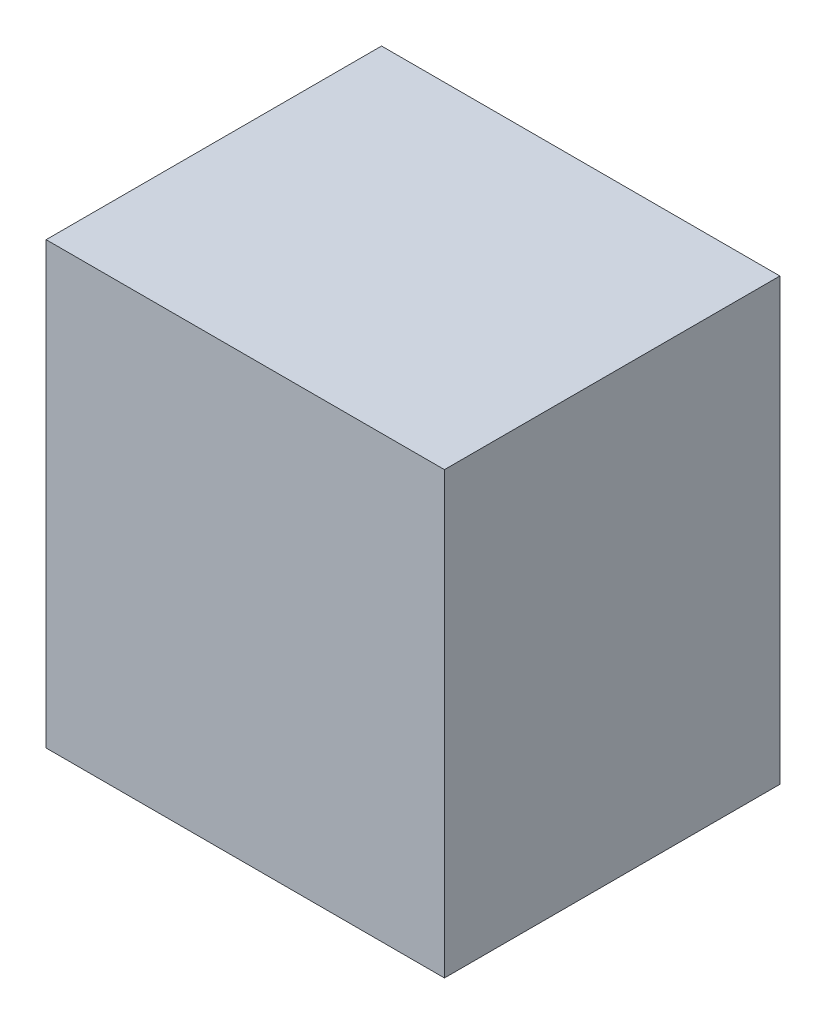
ISO-10303-21;
HEADER;
FILE_DESCRIPTION(('STEP AP214'),'2;1');
FILE_NAME('part.step','',(''),(''),'','','');
FILE_SCHEMA(('AUTOMOTIVE_DESIGN { 1 0 10303 214 1 1 1 1 }'));
ENDSEC;
DATA;
#1=APPLICATION_CONTEXT('core data for automotive mechanical design processes');
#2=APPLICATION_PROTOCOL_DEFINITION('international standard','automotive_design',2000,#1);
#3=PRODUCT_CONTEXT('',#1,'mechanical');
#4=PRODUCT('Part','Part','',(#3));
#5=PRODUCT_RELATED_PRODUCT_CATEGORY('part','',(#4));
#6=PRODUCT_DEFINITION_FORMATION('','',#4);
#7=PRODUCT_DEFINITION_CONTEXT('part definition',#1,'design');
#8=PRODUCT_DEFINITION('design','',#6,#7);
#9=PRODUCT_DEFINITION_SHAPE('','',#8);
#10=(LENGTH_UNIT() NAMED_UNIT(*) SI_UNIT(.MILLI.,.METRE.));
#11=(NAMED_UNIT(*) PLANE_ANGLE_UNIT() SI_UNIT($,.RADIAN.));
#12=(NAMED_UNIT(*) SI_UNIT($,.STERADIAN.) SOLID_ANGLE_UNIT());
#13=UNCERTAINTY_MEASURE_WITH_UNIT(LENGTH_MEASURE(1.E-05),#10,'distance_accuracy_value','');
#14=(GEOMETRIC_REPRESENTATION_CONTEXT(3) GLOBAL_UNCERTAINTY_ASSIGNED_CONTEXT((#13)) GLOBAL_UNIT_ASSIGNED_CONTEXT((#10,
#11,#12)) REPRESENTATION_CONTEXT('',''));
#15=CARTESIAN_POINT('',(0.,0.,0.));
#16=DIRECTION('',(0.,0.,1.));
#17=DIRECTION('',(1.,0.,0.));
#18=AXIS2_PLACEMENT_3D('',#15,#16,#17);
#19=CARTESIAN_POINT('',(0.47500032,-0.52500022,0.80000094));
#20=DIRECTION('',(0.,0.,1.));
#21=DIRECTION('',(1.,0.,0.));
#22=AXIS2_PLACEMENT_3D('',#19,#20,#21);
#23=PLANE('',#22);
#24=DIRECTION('',(0.,1.,0.));
#25=VECTOR('',#24,1.);
#26=CARTESIAN_POINT('',(-0.47499778,-0.52500022,0.80000094));
#27=LINE('',#26,#25);
#28=CARTESIAN_POINT('',(-0.47499778,-0.52500022,0.80000094));
#29=VERTEX_POINT('',#28);
#30=CARTESIAN_POINT('',(-0.47499778,0.52500022,0.80000094));
#31=VERTEX_POINT('',#30);
#32=EDGE_CURVE('E52',#29,#31,#27,.T.);
#33=ORIENTED_EDGE('',*,*,#32,.F.);
#34=DIRECTION('',(1.,0.,0.));
#35=VECTOR('',#34,1.);
#36=CARTESIAN_POINT('',(0.47500032,-0.52500022,0.80000094));
#37=LINE('',#36,#35);
#38=CARTESIAN_POINT('',(0.47500032,-0.52500022,0.80000094));
#39=VERTEX_POINT('',#38);
#40=EDGE_CURVE('E67',#39,#29,#37,.F.);
#41=ORIENTED_EDGE('',*,*,#40,.F.);
#42=DIRECTION('',(0.,1.,0.));
#43=VECTOR('',#42,1.);
#44=CARTESIAN_POINT('',(0.47500032,0.52500022,0.80000094));
#45=LINE('',#44,#43);
#46=CARTESIAN_POINT('',(0.47500032,0.52500022,0.80000094));
#47=VERTEX_POINT('',#46);
#48=EDGE_CURVE('E19',#47,#39,#45,.F.);
#49=ORIENTED_EDGE('',*,*,#48,.F.);
#50=DIRECTION('',(1.,0.,0.));
#51=VECTOR('',#50,1.);
#52=CARTESIAN_POINT('',(-0.47499778,0.52500022,0.80000094));
#53=LINE('',#52,#51);
#54=EDGE_CURVE('E57',#31,#47,#53,.T.);
#55=ORIENTED_EDGE('',*,*,#54,.F.);
#56=EDGE_LOOP('',(#33,#41,#49,#55));
#57=FACE_BOUND('',#56,.T.);
#58=ADVANCED_FACE('F16',(#57),#23,.T.);
#59=CARTESIAN_POINT('',(0.47500032,0.52500022,0.));
#60=DIRECTION('',(1.,0.,0.));
#61=DIRECTION('',(0.,0.,-1.));
#62=AXIS2_PLACEMENT_3D('',#59,#60,#61);
#63=PLANE('',#62);
#64=DIRECTION('',(0.,0.,-1.));
#65=VECTOR('',#64,1.);
#66=CARTESIAN_POINT('',(0.47500032,-0.52500022,0.));
#67=LINE('',#66,#65);
#68=CARTESIAN_POINT('',(0.47500032,-0.52500022,0.));
#69=VERTEX_POINT('',#68);
#70=EDGE_CURVE('E78',#69,#39,#67,.F.);
#71=ORIENTED_EDGE('',*,*,#70,.F.);
#72=DIRECTION('',(0.,1.,0.));
#73=VECTOR('',#72,1.);
#74=CARTESIAN_POINT('',(0.47500032,-0.52500022,0.));
#75=LINE('',#74,#73);
#76=CARTESIAN_POINT('',(0.47500032,0.52500022,0.));
#77=VERTEX_POINT('',#76);
#78=EDGE_CURVE('E73',#69,#77,#75,.T.);
#79=ORIENTED_EDGE('',*,*,#78,.T.);
#80=DIRECTION('',(0.,0.,1.));
#81=VECTOR('',#80,1.);
#82=CARTESIAN_POINT('',(0.47500032,0.52500022,0.));
#83=LINE('',#82,#81);
#84=EDGE_CURVE('E62',#47,#77,#83,.F.);
#85=ORIENTED_EDGE('',*,*,#84,.F.);
#86=ORIENTED_EDGE('',*,*,#48,.T.);
#87=EDGE_LOOP('',(#71,#79,#85,#86));
#88=FACE_BOUND('',#87,.T.);
#89=ADVANCED_FACE('F72',(#88),#63,.T.);
#90=CARTESIAN_POINT('',(-0.47499778,0.52500022,0.));
#91=DIRECTION('',(0.,1.,0.));
#92=DIRECTION('',(0.,0.,1.));
#93=AXIS2_PLACEMENT_3D('',#90,#91,#92);
#94=PLANE('',#93);
#95=ORIENTED_EDGE('',*,*,#84,.T.);
#96=DIRECTION('',(1.,0.,0.));
#97=VECTOR('',#96,1.);
#98=CARTESIAN_POINT('',(0.47500032,0.52500022,0.));
#99=LINE('',#98,#97);
#100=CARTESIAN_POINT('',(-0.47499778,0.52500022,0.));
#101=VERTEX_POINT('',#100);
#102=EDGE_CURVE('E83',#77,#101,#99,.F.);
#103=ORIENTED_EDGE('',*,*,#102,.T.);
#104=DIRECTION('',(0.,0.,1.));
#105=VECTOR('',#104,1.);
#106=CARTESIAN_POINT('',(-0.47499778,0.52500022,0.));
#107=LINE('',#106,#105);
#108=EDGE_CURVE('E64',#31,#101,#107,.F.);
#109=ORIENTED_EDGE('',*,*,#108,.F.);
#110=ORIENTED_EDGE('',*,*,#54,.T.);
#111=EDGE_LOOP('',(#95,#103,#109,#110));
#112=FACE_BOUND('',#111,.T.);
#113=ADVANCED_FACE('F59',(#112),#94,.T.);
#114=CARTESIAN_POINT('',(-0.47499778,-0.52500022,0.));
#115=DIRECTION('',(-1.,0.,0.));
#116=DIRECTION('',(0.,0.,1.));
#117=AXIS2_PLACEMENT_3D('',#114,#115,#116);
#118=PLANE('',#117);
#119=ORIENTED_EDGE('',*,*,#108,.T.);
#120=DIRECTION('',(0.,1.,0.));
#121=VECTOR('',#120,1.);
#122=CARTESIAN_POINT('',(-0.47499778,-0.52500022,0.));
#123=LINE('',#122,#121);
#124=CARTESIAN_POINT('',(-0.47499778,-0.52500022,0.));
#125=VERTEX_POINT('',#124);
#126=EDGE_CURVE('E25',#101,#125,#123,.F.);
#127=ORIENTED_EDGE('',*,*,#126,.T.);
#128=DIRECTION('',(0.,0.,-1.));
#129=VECTOR('',#128,1.);
#130=CARTESIAN_POINT('',(-0.47499778,-0.52500022,0.));
#131=LINE('',#130,#129);
#132=EDGE_CURVE('E33',#29,#125,#131,.T.);
#133=ORIENTED_EDGE('',*,*,#132,.F.);
#134=ORIENTED_EDGE('',*,*,#32,.T.);
#135=EDGE_LOOP('',(#119,#127,#133,#134));
#136=FACE_BOUND('',#135,.T.);
#137=ADVANCED_FACE('F87',(#136),#118,.T.);
#138=CARTESIAN_POINT('',(0.47500032,-0.52500022,0.));
#139=DIRECTION('',(0.,-1.,0.));
#140=DIRECTION('',(0.,0.,-1.));
#141=AXIS2_PLACEMENT_3D('',#138,#139,#140);
#142=PLANE('',#141);
#143=ORIENTED_EDGE('',*,*,#132,.T.);
#144=DIRECTION('',(1.,0.,0.));
#145=VECTOR('',#144,1.);
#146=CARTESIAN_POINT('',(0.47500032,-0.52500022,0.));
#147=LINE('',#146,#145);
#148=EDGE_CURVE('E11',#125,#69,#147,.T.);
#149=ORIENTED_EDGE('',*,*,#148,.T.);
#150=ORIENTED_EDGE('',*,*,#70,.T.);
#151=ORIENTED_EDGE('',*,*,#40,.T.);
#152=EDGE_LOOP('',(#143,#149,#150,#151));
#153=FACE_BOUND('',#152,.T.);
#154=ADVANCED_FACE('F90',(#153),#142,.T.);
#155=CARTESIAN_POINT('',(0.47500032,-0.52500022,0.));
#156=DIRECTION('',(0.,0.,1.));
#157=DIRECTION('',(1.,0.,0.));
#158=AXIS2_PLACEMENT_3D('',#155,#156,#157);
#159=PLANE('',#158);
#160=ORIENTED_EDGE('',*,*,#126,.F.);
#161=ORIENTED_EDGE('',*,*,#102,.F.);
#162=ORIENTED_EDGE('',*,*,#78,.F.);
#163=ORIENTED_EDGE('',*,*,#148,.F.);
#164=EDGE_LOOP('',(#160,#161,#162,#163));
#165=FACE_BOUND('',#164,.T.);
#166=ADVANCED_FACE('F89',(#165),#159,.F.);
#167=CLOSED_SHELL('',(#58,#89,#113,#137,#154,#166));
#168=MANIFOLD_SOLID_BREP('B1',#167);
#169=ADVANCED_BREP_SHAPE_REPRESENTATION('',(#18,#168),#14);
#170=SHAPE_DEFINITION_REPRESENTATION(#9,#169);
ENDSEC;
END-ISO-10303-21;
